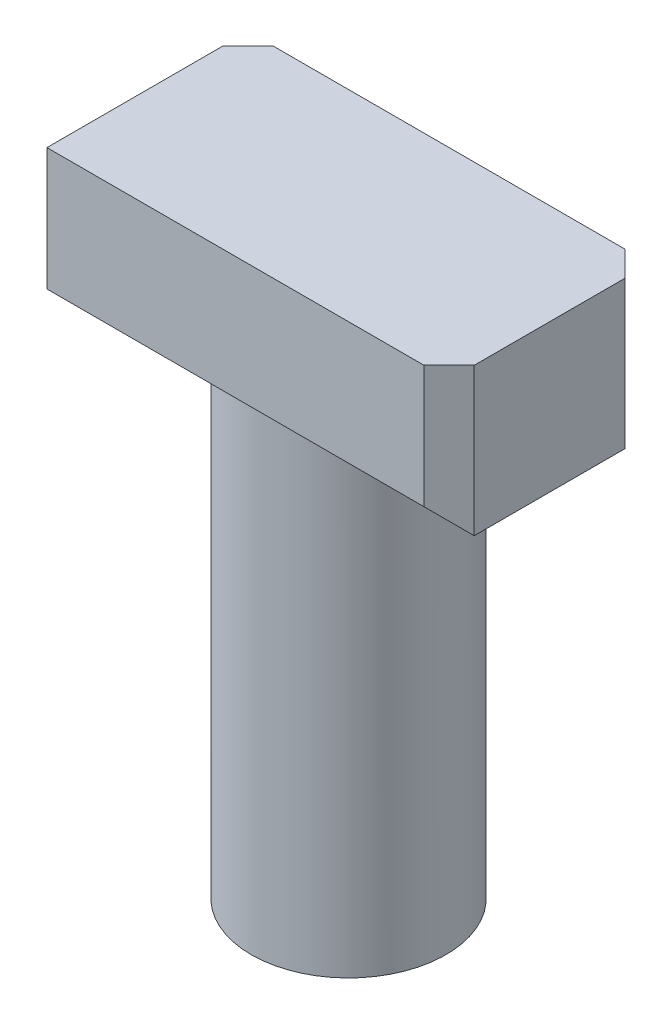
ISO-10303-21;
HEADER;
FILE_DESCRIPTION(('STEP AP214'),'2;1');
FILE_NAME('part.step','',(''),(''),'','','');
FILE_SCHEMA(('AUTOMOTIVE_DESIGN { 1 0 10303 214 1 1 1 1 }'));
ENDSEC;
DATA;
#1=APPLICATION_CONTEXT('core data for automotive mechanical design processes');
#2=APPLICATION_PROTOCOL_DEFINITION('international standard','automotive_design',2000,#1);
#3=PRODUCT_CONTEXT('',#1,'mechanical');
#4=PRODUCT('Part','Part','',(#3));
#5=PRODUCT_RELATED_PRODUCT_CATEGORY('part','',(#4));
#6=PRODUCT_DEFINITION_FORMATION('','',#4);
#7=PRODUCT_DEFINITION_CONTEXT('part definition',#1,'design');
#8=PRODUCT_DEFINITION('design','',#6,#7);
#9=PRODUCT_DEFINITION_SHAPE('','',#8);
#10=(LENGTH_UNIT() NAMED_UNIT(*) SI_UNIT(.MILLI.,.METRE.));
#11=(NAMED_UNIT(*) PLANE_ANGLE_UNIT() SI_UNIT($,.RADIAN.));
#12=(NAMED_UNIT(*) SI_UNIT($,.STERADIAN.) SOLID_ANGLE_UNIT());
#13=UNCERTAINTY_MEASURE_WITH_UNIT(LENGTH_MEASURE(1.E-05),#10,'distance_accuracy_value','');
#14=(GEOMETRIC_REPRESENTATION_CONTEXT(3) GLOBAL_UNCERTAINTY_ASSIGNED_CONTEXT((#13)) GLOBAL_UNIT_ASSIGNED_CONTEXT((#10,
#11,#12)) REPRESENTATION_CONTEXT('',''));
#15=CARTESIAN_POINT('',(0.,0.,0.));
#16=DIRECTION('',(0.,0.,1.));
#17=DIRECTION('',(1.,0.,0.));
#18=AXIS2_PLACEMENT_3D('',#15,#16,#17);
#19=CARTESIAN_POINT('',(0.,28.575,0.));
#20=DIRECTION('',(0.,1.,0.));
#21=DIRECTION('',(0.,0.,1.));
#22=AXIS2_PLACEMENT_3D('',#19,#20,#21);
#23=PLANE('',#22);
#24=DIRECTION('',(0.,0.,-1.));
#25=VECTOR('',#24,1.);
#26=CARTESIAN_POINT('',(12.7,28.575,4.84289341559805));
#27=LINE('',#26,#25);
#28=CARTESIAN_POINT('',(12.7,28.575,3.25539341559804));
#29=VERTEX_POINT('',#28);
#30=CARTESIAN_POINT('',(12.7,28.575,-6.26960658440194));
#31=VERTEX_POINT('',#30);
#32=EDGE_CURVE('E122',#29,#31,#27,.T.);
#33=ORIENTED_EDGE('',*,*,#32,.F.);
#34=DIRECTION('',(-1.,0.,0.));
#35=VECTOR('',#34,1.);
#36=CARTESIAN_POINT('',(0.,28.575,3.25539341559805));
#37=LINE('',#36,#35);
#38=CARTESIAN_POINT('',(3.89115583728024,28.575,3.25539341559805));
#39=VERTEX_POINT('',#38);
#40=EDGE_CURVE('E169',#29,#39,#37,.T.);
#41=ORIENTED_EDGE('',*,*,#40,.T.);
#42=CARTESIAN_POINT('',(0.,28.575,-1.50710658440194));
#43=DIRECTION('',(0.,1.,0.));
#44=DIRECTION('',(0.,0.,1.));
#45=AXIS2_PLACEMENT_3D('',#42,#43,#44);
#46=CIRCLE('',#45,6.15);
#47=CARTESIAN_POINT('',(3.89115583728024,28.575,-6.26960658440193));
#48=VERTEX_POINT('',#47);
#49=EDGE_CURVE('E145',#39,#48,#46,.T.);
#50=ORIENTED_EDGE('',*,*,#49,.T.);
#51=DIRECTION('',(1.,0.,0.));
#52=VECTOR('',#51,1.);
#53=CARTESIAN_POINT('',(0.,28.575,-6.26960658440193));
#54=LINE('',#53,#52);
#55=EDGE_CURVE('E161',#48,#31,#54,.T.);
#56=ORIENTED_EDGE('',*,*,#55,.T.);
#57=EDGE_LOOP('',(#33,#41,#50,#56));
#58=FACE_BOUND('',#57,.T.);
#59=ADVANCED_FACE('F33',(#58),#23,.F.);
#60=CARTESIAN_POINT('',(0.,28.575,-1.50710658440194));
#61=DIRECTION('',(0.,-1.,0.));
#62=DIRECTION('',(0.,0.,-1.));
#63=AXIS2_PLACEMENT_3D('',#60,#61,#62);
#64=CYLINDRICAL_SURFACE('',#63,6.15);
#65=ORIENTED_EDGE('',*,*,#49,.F.);
#66=CARTESIAN_POINT('',(0.,23.8125,-1.50710658440194));
#67=DIRECTION('',(0.,0.707106781186544,-0.707106781186551));
#68=DIRECTION('',(0.,-0.707106781186551,-0.707106781186544));
#69=AXIS2_PLACEMENT_3D('',#66,#67,#68);
#70=ELLIPSE('',#69,8.69741340859457,6.15);
#71=CARTESIAN_POINT('',(-3.89115583728024,28.575,3.25539341559805));
#72=VERTEX_POINT('',#71);
#73=EDGE_CURVE('E42',#39,#72,#70,.F.);
#74=ORIENTED_EDGE('',*,*,#73,.T.);
#75=CARTESIAN_POINT('',(-3.89115583728024,28.575,-6.26960658440193));
#76=VERTEX_POINT('',#75);
#77=EDGE_CURVE('E140',#76,#72,#46,.T.);
#78=ORIENTED_EDGE('',*,*,#77,.F.);
#79=CARTESIAN_POINT('',(0.,23.8125,-1.50710658440194));
#80=DIRECTION('',(0.,0.707106781186544,0.707106781186551));
#81=DIRECTION('',(0.,-0.707106781186551,0.707106781186544));
#82=AXIS2_PLACEMENT_3D('',#79,#80,#81);
#83=ELLIPSE('',#82,8.69741340859458,6.15);
#84=EDGE_CURVE('E11',#76,#48,#83,.F.);
#85=ORIENTED_EDGE('',*,*,#84,.T.);
#86=EDGE_LOOP('',(#65,#74,#78,#85));
#87=FACE_BOUND('',#86,.T.);
#88=CARTESIAN_POINT('',(0.,0.,-1.50710658440194));
#89=DIRECTION('',(0.,1.,0.));
#90=DIRECTION('',(0.,0.,1.));
#91=AXIS2_PLACEMENT_3D('',#88,#89,#90);
#92=CIRCLE('',#91,6.15);
#93=CARTESIAN_POINT('',(0.,0.,4.64289341559806));
#94=VERTEX_POINT('',#93);
#95=EDGE_CURVE('E136',#94,#94,#92,.T.);
#96=ORIENTED_EDGE('',*,*,#95,.T.);
#97=EDGE_LOOP('',(#96));
#98=FACE_BOUND('',#97,.T.);
#99=ADVANCED_FACE('F231',(#87,#98),#64,.T.);
#100=CARTESIAN_POINT('',(0.,0.,-1.50710658440194));
#101=DIRECTION('',(0.,1.,0.));
#102=DIRECTION('',(0.,0.,1.));
#103=AXIS2_PLACEMENT_3D('',#100,#101,#102);
#104=PLANE('',#103);
#105=ORIENTED_EDGE('',*,*,#95,.F.);
#106=EDGE_LOOP('',(#105));
#107=FACE_BOUND('',#106,.T.);
#108=ADVANCED_FACE('F249',(#107),#104,.F.);
#109=CARTESIAN_POINT('',(-12.7,37.9,4.84289341559806));
#110=DIRECTION('',(1.,0.,0.));
#111=DIRECTION('',(0.,0.,-1.));
#112=AXIS2_PLACEMENT_3D('',#109,#110,#111);
#113=PLANE('',#112);
#114=DIRECTION('',(0.,-1.,0.));
#115=VECTOR('',#114,1.);
#116=CARTESIAN_POINT('',(-12.7,37.9,-6.26960658440193));
#117=LINE('',#116,#115);
#118=CARTESIAN_POINT('',(-12.7,37.9,-6.26960658440193));
#119=VERTEX_POINT('',#118);
#120=CARTESIAN_POINT('',(-12.7,30.1625,-6.26960658440193));
#121=VERTEX_POINT('',#120);
#122=EDGE_CURVE('E171',#119,#121,#117,.T.);
#123=ORIENTED_EDGE('',*,*,#122,.T.);
#124=DIRECTION('',(0.,0.,1.));
#125=VECTOR('',#124,1.);
#126=CARTESIAN_POINT('',(-12.7,30.1625,4.84289341559806));
#127=LINE('',#126,#125);
#128=CARTESIAN_POINT('',(-12.7,30.1625,4.84289341559806));
#129=VERTEX_POINT('',#128);
#130=EDGE_CURVE('E135',#121,#129,#127,.T.);
#131=ORIENTED_EDGE('',*,*,#130,.T.);
#132=DIRECTION('',(0.,-1.,0.));
#133=VECTOR('',#132,1.);
#134=CARTESIAN_POINT('',(-12.7,37.9,4.84289341559806));
#135=LINE('',#134,#133);
#136=CARTESIAN_POINT('',(-12.7,37.9,4.84289341559806));
#137=VERTEX_POINT('',#136);
#138=EDGE_CURVE('E127',#137,#129,#135,.T.);
#139=ORIENTED_EDGE('',*,*,#138,.F.);
#140=DIRECTION('',(0.,0.,1.));
#141=VECTOR('',#140,1.);
#142=CARTESIAN_POINT('',(-12.7,37.9,4.84289341559806));
#143=LINE('',#142,#141);
#144=EDGE_CURVE('E111',#119,#137,#143,.T.);
#145=ORIENTED_EDGE('',*,*,#144,.F.);
#146=EDGE_LOOP('',(#123,#131,#139,#145));
#147=FACE_BOUND('',#146,.T.);
#148=ADVANCED_FACE('F133',(#147),#113,.F.);
#149=CARTESIAN_POINT('',(12.7,37.9,4.84289341559805));
#150=DIRECTION('',(0.,0.,-1.));
#151=DIRECTION('',(-1.,0.,0.));
#152=AXIS2_PLACEMENT_3D('',#149,#150,#151);
#153=PLANE('',#152);
#154=DIRECTION('',(1.,0.,0.));
#155=VECTOR('',#154,1.);
#156=CARTESIAN_POINT('',(12.7,30.1625,4.84289341559805));
#157=LINE('',#156,#155);
#158=CARTESIAN_POINT('',(11.1125,30.1625,4.84289341559805));
#159=VERTEX_POINT('',#158);
#160=EDGE_CURVE('E153',#129,#159,#157,.T.);
#161=ORIENTED_EDGE('',*,*,#160,.T.);
#162=DIRECTION('',(0.,1.,0.));
#163=VECTOR('',#162,1.);
#164=CARTESIAN_POINT('',(11.1125,37.9,4.84289341559805));
#165=LINE('',#164,#163);
#166=CARTESIAN_POINT('',(11.1125,37.9,4.84289341559805));
#167=VERTEX_POINT('',#166);
#168=EDGE_CURVE('E130',#159,#167,#165,.T.);
#169=ORIENTED_EDGE('',*,*,#168,.T.);
#170=DIRECTION('',(1.,0.,0.));
#171=VECTOR('',#170,1.);
#172=CARTESIAN_POINT('',(12.7,37.9,4.84289341559805));
#173=LINE('',#172,#171);
#174=EDGE_CURVE('E114',#137,#167,#173,.T.);
#175=ORIENTED_EDGE('',*,*,#174,.F.);
#176=ORIENTED_EDGE('',*,*,#138,.T.);
#177=EDGE_LOOP('',(#161,#169,#175,#176));
#178=FACE_BOUND('',#177,.T.);
#179=ADVANCED_FACE('F126',(#178),#153,.F.);
#180=CARTESIAN_POINT('',(12.7,37.9,4.84289341559805));
#181=DIRECTION('',(-1.,0.,0.));
#182=DIRECTION('',(0.,0.,1.));
#183=AXIS2_PLACEMENT_3D('',#180,#181,#182);
#184=PLANE('',#183);
#185=DIRECTION('',(0.,0.,-1.));
#186=VECTOR('',#185,1.);
#187=CARTESIAN_POINT('',(12.7,37.9,4.84289341559805));
#188=LINE('',#187,#186);
#189=CARTESIAN_POINT('',(12.7,37.9,3.25539341559803));
#190=VERTEX_POINT('',#189);
#191=CARTESIAN_POINT('',(12.7,37.9,-6.26960658440193));
#192=VERTEX_POINT('',#191);
#193=EDGE_CURVE('E131',#190,#192,#188,.T.);
#194=ORIENTED_EDGE('',*,*,#193,.F.);
#195=DIRECTION('',(0.,-1.,0.));
#196=VECTOR('',#195,1.);
#197=CARTESIAN_POINT('',(12.7,37.9,3.25539341559803));
#198=LINE('',#197,#196);
#199=EDGE_CURVE('E150',#190,#29,#198,.T.);
#200=ORIENTED_EDGE('',*,*,#199,.T.);
#201=ORIENTED_EDGE('',*,*,#32,.T.);
#202=DIRECTION('',(0.,1.,0.));
#203=VECTOR('',#202,1.);
#204=CARTESIAN_POINT('',(12.7,37.9,-6.26960658440194));
#205=LINE('',#204,#203);
#206=EDGE_CURVE('E147',#31,#192,#205,.T.);
#207=ORIENTED_EDGE('',*,*,#206,.T.);
#208=EDGE_LOOP('',(#194,#200,#201,#207));
#209=FACE_BOUND('',#208,.T.);
#210=ADVANCED_FACE('F202',(#209),#184,.F.);
#211=CARTESIAN_POINT('',(12.7,37.9,-7.85710658440195));
#212=DIRECTION('',(0.,0.,1.));
#213=DIRECTION('',(1.,0.,0.));
#214=AXIS2_PLACEMENT_3D('',#211,#212,#213);
#215=PLANE('',#214);
#216=DIRECTION('',(-1.,0.,0.));
#217=VECTOR('',#216,1.);
#218=CARTESIAN_POINT('',(12.7,37.9,-7.85710658440195));
#219=LINE('',#218,#217);
#220=CARTESIAN_POINT('',(11.1125,37.9,-7.85710658440195));
#221=VERTEX_POINT('',#220);
#222=CARTESIAN_POINT('',(-11.1125,37.9,-7.85710658440194));
#223=VERTEX_POINT('',#222);
#224=EDGE_CURVE('E137',#221,#223,#219,.T.);
#225=ORIENTED_EDGE('',*,*,#224,.F.);
#226=DIRECTION('',(0.,-1.,0.));
#227=VECTOR('',#226,1.);
#228=CARTESIAN_POINT('',(11.1125,37.9,-7.85710658440195));
#229=LINE('',#228,#227);
#230=CARTESIAN_POINT('',(11.1125,30.1625,-7.85710658440195));
#231=VERTEX_POINT('',#230);
#232=EDGE_CURVE('E55',#221,#231,#229,.T.);
#233=ORIENTED_EDGE('',*,*,#232,.T.);
#234=DIRECTION('',(-1.,0.,0.));
#235=VECTOR('',#234,1.);
#236=CARTESIAN_POINT('',(12.7,30.1625,-7.85710658440195));
#237=LINE('',#236,#235);
#238=CARTESIAN_POINT('',(-11.1125,30.1625,-7.85710658440194));
#239=VERTEX_POINT('',#238);
#240=EDGE_CURVE('E50',#231,#239,#237,.T.);
#241=ORIENTED_EDGE('',*,*,#240,.T.);
#242=DIRECTION('',(0.,1.,0.));
#243=VECTOR('',#242,1.);
#244=CARTESIAN_POINT('',(-11.1125,37.9,-7.85710658440194));
#245=LINE('',#244,#243);
#246=EDGE_CURVE('E175',#239,#223,#245,.T.);
#247=ORIENTED_EDGE('',*,*,#246,.T.);
#248=EDGE_LOOP('',(#225,#233,#241,#247));
#249=FACE_BOUND('',#248,.T.);
#250=ADVANCED_FACE('F208',(#249),#215,.F.);
#251=CARTESIAN_POINT('',(0.,37.9,0.));
#252=DIRECTION('',(0.,1.,0.));
#253=DIRECTION('',(0.,0.,1.));
#254=AXIS2_PLACEMENT_3D('',#251,#252,#253);
#255=PLANE('',#254);
#256=ORIENTED_EDGE('',*,*,#174,.T.);
#257=DIRECTION('',(-0.707106781186544,0.,0.707106781186551));
#258=VECTOR('',#257,1.);
#259=CARTESIAN_POINT('',(7.97769670779908,37.9,7.977696707799));
#260=LINE('',#259,#258);
#261=EDGE_CURVE('E159',#167,#190,#260,.F.);
#262=ORIENTED_EDGE('',*,*,#261,.T.);
#263=ORIENTED_EDGE('',*,*,#193,.T.);
#264=DIRECTION('',(0.707106781186551,0.,0.707106781186544));
#265=VECTOR('',#264,1.);
#266=CARTESIAN_POINT('',(9.4848032922009,37.9,-9.48480329220101));
#267=LINE('',#266,#265);
#268=EDGE_CURVE('E157',#192,#221,#267,.F.);
#269=ORIENTED_EDGE('',*,*,#268,.T.);
#270=ORIENTED_EDGE('',*,*,#224,.T.);
#271=DIRECTION('',(0.707106781186551,0.,-0.707106781186544));
#272=VECTOR('',#271,1.);
#273=CARTESIAN_POINT('',(-9.4848032922009,37.9,-9.48480329220099));
#274=LINE('',#273,#272);
#275=EDGE_CURVE('E118',#223,#119,#274,.F.);
#276=ORIENTED_EDGE('',*,*,#275,.T.);
#277=ORIENTED_EDGE('',*,*,#144,.T.);
#278=EDGE_LOOP('',(#256,#262,#263,#269,#270,#276,#277));
#279=FACE_BOUND('',#278,.T.);
#280=ADVANCED_FACE('F113',(#279),#255,.T.);
#281=ORIENTED_EDGE('',*,*,#77,.T.);
#282=DIRECTION('',(-1.,0.,0.));
#283=VECTOR('',#282,1.);
#284=CARTESIAN_POINT('',(0.,28.575,3.25539341559805));
#285=LINE('',#284,#283);
#286=CARTESIAN_POINT('',(-11.1125,28.575,3.25539341559805));
#287=VERTEX_POINT('',#286);
#288=EDGE_CURVE('E167',#72,#287,#285,.T.);
#289=ORIENTED_EDGE('',*,*,#288,.T.);
#290=DIRECTION('',(0.,0.,-1.));
#291=VECTOR('',#290,1.);
#292=CARTESIAN_POINT('',(-11.1125,28.575,0.));
#293=LINE('',#292,#291);
#294=CARTESIAN_POINT('',(-11.1125,28.575,-6.26960658440193));
#295=VERTEX_POINT('',#294);
#296=EDGE_CURVE('E165',#287,#295,#293,.T.);
#297=ORIENTED_EDGE('',*,*,#296,.T.);
#298=DIRECTION('',(1.,0.,0.));
#299=VECTOR('',#298,1.);
#300=CARTESIAN_POINT('',(0.,28.575,-6.26960658440193));
#301=LINE('',#300,#299);
#302=EDGE_CURVE('E163',#295,#76,#301,.T.);
#303=ORIENTED_EDGE('',*,*,#302,.T.);
#304=EDGE_LOOP('',(#281,#289,#297,#303));
#305=FACE_BOUND('',#304,.T.);
#306=ADVANCED_FACE('F236',(#305),#23,.F.);
#307=CARTESIAN_POINT('',(11.1125,37.9,-7.85710658440195));
#308=DIRECTION('',(-0.707106781186544,0.,0.707106781186551));
#309=DIRECTION('',(0.,-1.,0.));
#310=AXIS2_PLACEMENT_3D('',#307,#308,#309);
#311=PLANE('',#310);
#312=ORIENTED_EDGE('',*,*,#268,.F.);
#313=ORIENTED_EDGE('',*,*,#206,.F.);
#314=DIRECTION('',(0.577350269189628,-0.577350269189628,0.577350269189622));
#315=VECTOR('',#314,1.);
#316=CARTESIAN_POINT('',(11.6416666666667,29.6333333333333,-7.32793991773527));
#317=LINE('',#316,#315);
#318=EDGE_CURVE('E37',#231,#31,#317,.T.);
#319=ORIENTED_EDGE('',*,*,#318,.F.);
#320=ORIENTED_EDGE('',*,*,#232,.F.);
#321=EDGE_LOOP('',(#312,#313,#319,#320));
#322=FACE_BOUND('',#321,.T.);
#323=ADVANCED_FACE('F35',(#322),#311,.F.);
#324=CARTESIAN_POINT('',(12.7,30.1625,-7.85710658440195));
#325=DIRECTION('',(0.,0.707106781186544,0.707106781186551));
#326=DIRECTION('',(-1.,0.,0.));
#327=AXIS2_PLACEMENT_3D('',#324,#325,#326);
#328=PLANE('',#327);
#329=ORIENTED_EDGE('',*,*,#84,.F.);
#330=ORIENTED_EDGE('',*,*,#302,.F.);
#331=DIRECTION('',(0.,0.707106781186551,-0.707106781186544));
#332=VECTOR('',#331,1.);
#333=CARTESIAN_POINT('',(-11.1125,28.575,-6.26960658440193));
#334=LINE('',#333,#332);
#335=EDGE_CURVE('E189',#239,#295,#334,.F.);
#336=ORIENTED_EDGE('',*,*,#335,.F.);
#337=ORIENTED_EDGE('',*,*,#240,.F.);
#338=ORIENTED_EDGE('',*,*,#318,.T.);
#339=ORIENTED_EDGE('',*,*,#55,.F.);
#340=EDGE_LOOP('',(#329,#330,#336,#337,#338,#339));
#341=FACE_BOUND('',#340,.T.);
#342=ADVANCED_FACE('F214',(#341),#328,.F.);
#343=CARTESIAN_POINT('',(-12.7,37.9,-6.26960658440193));
#344=DIRECTION('',(0.707106781186544,0.,0.707106781186551));
#345=DIRECTION('',(0.,-1.,0.));
#346=AXIS2_PLACEMENT_3D('',#343,#344,#345);
#347=PLANE('',#346);
#348=ORIENTED_EDGE('',*,*,#275,.F.);
#349=ORIENTED_EDGE('',*,*,#246,.F.);
#350=DIRECTION('',(-0.707106781186551,0.,0.707106781186544));
#351=VECTOR('',#350,1.);
#352=CARTESIAN_POINT('',(-11.90625,30.1625,-7.06335658440194));
#353=LINE('',#352,#351);
#354=EDGE_CURVE('E187',#121,#239,#353,.F.);
#355=ORIENTED_EDGE('',*,*,#354,.F.);
#356=ORIENTED_EDGE('',*,*,#122,.F.);
#357=EDGE_LOOP('',(#348,#349,#355,#356));
#358=FACE_BOUND('',#357,.T.);
#359=ADVANCED_FACE('F211',(#358),#347,.F.);
#360=CARTESIAN_POINT('',(-11.1125,28.575,-6.26960658440193));
#361=DIRECTION('',(-0.577350269189626,-0.57735026918962,-0.577350269189631));
#362=DIRECTION('',(-0.707106781186551,0.,0.707106781186544));
#363=AXIS2_PLACEMENT_3D('',#360,#361,#362);
#364=PLANE('',#363);
#365=ORIENTED_EDGE('',*,*,#354,.T.);
#366=ORIENTED_EDGE('',*,*,#335,.T.);
#367=DIRECTION('',(0.707106781186544,-0.707106781186551,0.));
#368=VECTOR('',#367,1.);
#369=CARTESIAN_POINT('',(-11.1125,28.575,-6.26960658440193));
#370=LINE('',#369,#368);
#371=EDGE_CURVE('E184',#121,#295,#370,.T.);
#372=ORIENTED_EDGE('',*,*,#371,.F.);
#373=EDGE_LOOP('',(#365,#366,#372));
#374=FACE_BOUND('',#373,.T.);
#375=ADVANCED_FACE('F215',(#374),#364,.T.);
#376=CARTESIAN_POINT('',(-12.7,30.1625,4.84289341559806));
#377=DIRECTION('',(0.707106781186551,0.707106781186544,0.));
#378=DIRECTION('',(0.,0.,1.));
#379=AXIS2_PLACEMENT_3D('',#376,#377,#378);
#380=PLANE('',#379);
#381=ORIENTED_EDGE('',*,*,#371,.T.);
#382=ORIENTED_EDGE('',*,*,#296,.F.);
#383=DIRECTION('',(-0.577350269189624,0.57735026918963,0.577350269189624));
#384=VECTOR('',#383,1.);
#385=CARTESIAN_POINT('',(-12.7,30.1625,4.84289341559806));
#386=LINE('',#385,#384);
#387=EDGE_CURVE('E181',#129,#287,#386,.F.);
#388=ORIENTED_EDGE('',*,*,#387,.F.);
#389=ORIENTED_EDGE('',*,*,#130,.F.);
#390=EDGE_LOOP('',(#381,#382,#388,#389));
#391=FACE_BOUND('',#390,.T.);
#392=ADVANCED_FACE('F218',(#391),#380,.F.);
#393=CARTESIAN_POINT('',(12.7,30.1625,4.84289341559805));
#394=DIRECTION('',(0.,0.707106781186544,-0.707106781186551));
#395=DIRECTION('',(1.,0.,0.));
#396=AXIS2_PLACEMENT_3D('',#393,#394,#395);
#397=PLANE('',#396);
#398=ORIENTED_EDGE('',*,*,#73,.F.);
#399=ORIENTED_EDGE('',*,*,#40,.F.);
#400=DIRECTION('',(-0.57735026918962,0.577350269189632,0.577350269189626));
#401=VECTOR('',#400,1.);
#402=CARTESIAN_POINT('',(11.6416666666667,29.6333333333334,4.31372674893139));
#403=LINE('',#402,#401);
#404=EDGE_CURVE('E179',#159,#29,#403,.F.);
#405=ORIENTED_EDGE('',*,*,#404,.F.);
#406=ORIENTED_EDGE('',*,*,#160,.F.);
#407=ORIENTED_EDGE('',*,*,#387,.T.);
#408=ORIENTED_EDGE('',*,*,#288,.F.);
#409=EDGE_LOOP('',(#398,#399,#405,#406,#407,#408));
#410=FACE_BOUND('',#409,.T.);
#411=ADVANCED_FACE('F224',(#410),#397,.F.);
#412=CARTESIAN_POINT('',(12.7,37.9,3.25539341559803));
#413=DIRECTION('',(-0.707106781186551,0.,-0.707106781186544));
#414=DIRECTION('',(0.,-1.,0.));
#415=AXIS2_PLACEMENT_3D('',#412,#413,#414);
#416=PLANE('',#415);
#417=ORIENTED_EDGE('',*,*,#261,.F.);
#418=ORIENTED_EDGE('',*,*,#168,.F.);
#419=ORIENTED_EDGE('',*,*,#404,.T.);
#420=ORIENTED_EDGE('',*,*,#199,.F.);
#421=EDGE_LOOP('',(#417,#418,#419,#420));
#422=FACE_BOUND('',#421,.T.);
#423=ADVANCED_FACE('F227',(#422),#416,.F.);
#424=CLOSED_SHELL('',(#59,#99,#108,#148,#179,#210,#250,#280,#306,#323,#342,#359,#375,#392,#411,#423));
#425=MANIFOLD_SOLID_BREP('B2',#424);
#426=ADVANCED_BREP_SHAPE_REPRESENTATION('',(#18,#425),#14);
#427=SHAPE_DEFINITION_REPRESENTATION(#9,#426);
ENDSEC;
END-ISO-10303-21;
